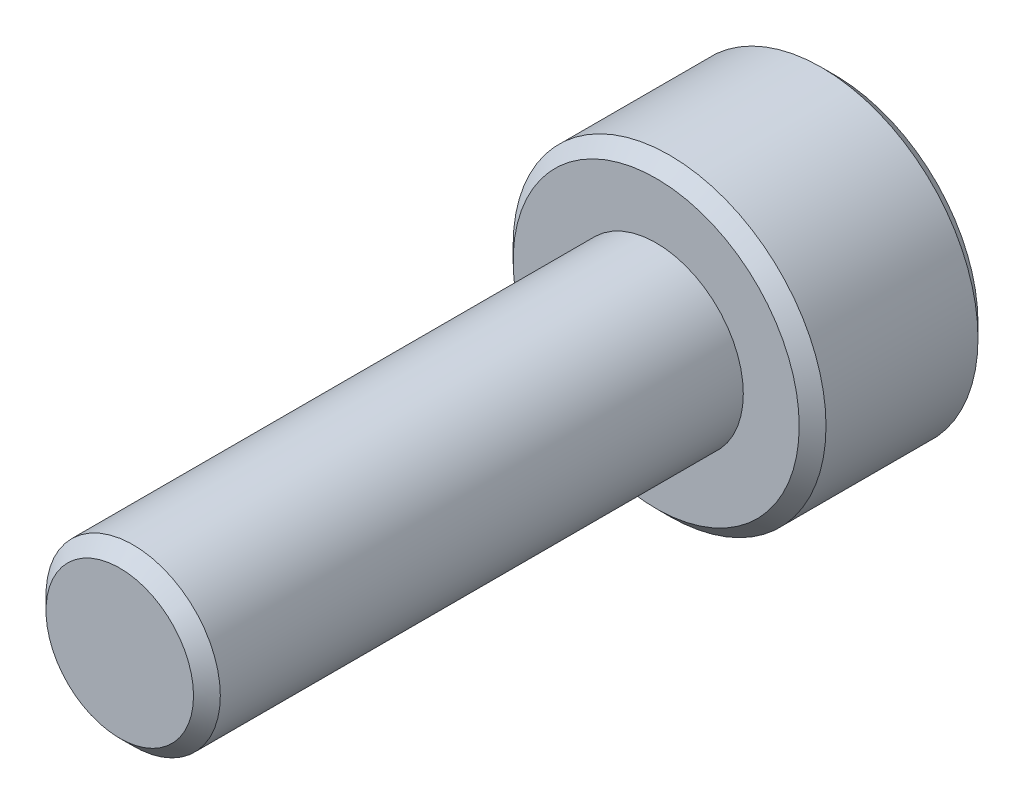
ISO-10303-21;
HEADER;
FILE_DESCRIPTION(('STEP AP214'),'2;1');
FILE_NAME('part.step','',(''),(''),'','','');
FILE_SCHEMA(('AUTOMOTIVE_DESIGN { 1 0 10303 214 1 1 1 1 }'));
ENDSEC;
DATA;
#1=APPLICATION_CONTEXT('core data for automotive mechanical design processes');
#2=APPLICATION_PROTOCOL_DEFINITION('international standard','automotive_design',2000,#1);
#3=PRODUCT_CONTEXT('',#1,'mechanical');
#4=PRODUCT('Part','Part','',(#3));
#5=PRODUCT_RELATED_PRODUCT_CATEGORY('part','',(#4));
#6=PRODUCT_DEFINITION_FORMATION('','',#4);
#7=PRODUCT_DEFINITION_CONTEXT('part definition',#1,'design');
#8=PRODUCT_DEFINITION('design','',#6,#7);
#9=PRODUCT_DEFINITION_SHAPE('','',#8);
#10=(LENGTH_UNIT() NAMED_UNIT(*) SI_UNIT(.MILLI.,.METRE.));
#11=(NAMED_UNIT(*) PLANE_ANGLE_UNIT() SI_UNIT($,.RADIAN.));
#12=(NAMED_UNIT(*) SI_UNIT($,.STERADIAN.) SOLID_ANGLE_UNIT());
#13=UNCERTAINTY_MEASURE_WITH_UNIT(LENGTH_MEASURE(1.E-05),#10,'distance_accuracy_value','');
#14=(GEOMETRIC_REPRESENTATION_CONTEXT(3) GLOBAL_UNCERTAINTY_ASSIGNED_CONTEXT((#13)) GLOBAL_UNIT_ASSIGNED_CONTEXT((#10,
#11,#12)) REPRESENTATION_CONTEXT('',''));
#15=CARTESIAN_POINT('',(0.,0.,0.));
#16=DIRECTION('',(0.,0.,1.));
#17=DIRECTION('',(1.,0.,0.));
#18=AXIS2_PLACEMENT_3D('',#15,#16,#17);
#19=CARTESIAN_POINT('',(0.,0.,4.));
#20=DIRECTION('',(0.,0.,-1.));
#21=DIRECTION('',(-1.,0.,0.));
#22=AXIS2_PLACEMENT_3D('',#19,#20,#21);
#23=CYLINDRICAL_SURFACE('',#22,3.5);
#24=CARTESIAN_POINT('',(0.,0.,3.7));
#25=DIRECTION('',(0.,0.,1.));
#26=DIRECTION('',(1.,0.,0.));
#27=AXIS2_PLACEMENT_3D('',#24,#25,#26);
#28=CIRCLE('',#27,3.5);
#29=CARTESIAN_POINT('',(3.5,0.,3.7));
#30=VERTEX_POINT('',#29);
#31=EDGE_CURVE('E176',#30,#30,#28,.F.);
#32=ORIENTED_EDGE('',*,*,#31,.T.);
#33=EDGE_LOOP('',(#32));
#34=FACE_BOUND('',#33,.T.);
#35=CARTESIAN_POINT('',(0.,0.,0.300000000000004));
#36=DIRECTION('',(0.,0.,1.));
#37=DIRECTION('',(1.,0.,0.));
#38=AXIS2_PLACEMENT_3D('',#35,#36,#37);
#39=CIRCLE('',#38,3.5);
#40=CARTESIAN_POINT('',(3.5,0.,0.300000000000004));
#41=VERTEX_POINT('',#40);
#42=EDGE_CURVE('E172',#41,#41,#39,.T.);
#43=ORIENTED_EDGE('',*,*,#42,.T.);
#44=EDGE_LOOP('',(#43));
#45=FACE_BOUND('',#44,.T.);
#46=ADVANCED_FACE('F38',(#34,#45),#23,.T.);
#47=CARTESIAN_POINT('',(0.,0.,4.));
#48=DIRECTION('',(0.,0.,1.));
#49=DIRECTION('',(1.,0.,0.));
#50=AXIS2_PLACEMENT_3D('',#47,#48,#49);
#51=PLANE('',#50);
#52=CARTESIAN_POINT('',(0.,0.,4.));
#53=DIRECTION('',(0.,0.,1.));
#54=DIRECTION('',(1.,0.,0.));
#55=AXIS2_PLACEMENT_3D('',#52,#53,#54);
#56=CIRCLE('',#55,3.2);
#57=CARTESIAN_POINT('',(3.2,0.,4.));
#58=VERTEX_POINT('',#57);
#59=EDGE_CURVE('E168',#58,#58,#56,.T.);
#60=ORIENTED_EDGE('',*,*,#59,.T.);
#61=EDGE_LOOP('',(#60));
#62=FACE_BOUND('',#61,.T.);
#63=CARTESIAN_POINT('',(0.,0.,4.));
#64=DIRECTION('',(0.,0.,1.));
#65=DIRECTION('',(1.,0.,0.));
#66=AXIS2_PLACEMENT_3D('',#63,#64,#65);
#67=CIRCLE('',#66,1.95);
#68=CARTESIAN_POINT('',(1.95,0.,4.));
#69=VERTEX_POINT('',#68);
#70=EDGE_CURVE('E156',#69,#69,#67,.T.);
#71=ORIENTED_EDGE('',*,*,#70,.F.);
#72=EDGE_LOOP('',(#71));
#73=FACE_BOUND('',#72,.T.);
#74=ADVANCED_FACE('F204',(#62,#73),#51,.T.);
#75=CARTESIAN_POINT('',(0.,0.,0.));
#76=DIRECTION('',(0.,0.,1.));
#77=DIRECTION('',(1.,0.,0.));
#78=AXIS2_PLACEMENT_3D('',#75,#76,#77);
#79=PLANE('',#78);
#80=DIRECTION('',(0.866025403784439,0.5,0.));
#81=VECTOR('',#80,1.);
#82=CARTESIAN_POINT('',(-1.5,0.866025403784438,0.));
#83=LINE('',#82,#81);
#84=CARTESIAN_POINT('',(-1.5,0.866025403784438,0.));
#85=VERTEX_POINT('',#84);
#86=CARTESIAN_POINT('',(0.,1.73205080756888,0.));
#87=VERTEX_POINT('',#86);
#88=EDGE_CURVE('E138',#85,#87,#83,.T.);
#89=ORIENTED_EDGE('',*,*,#88,.F.);
#90=DIRECTION('',(0.,1.,0.));
#91=VECTOR('',#90,1.);
#92=CARTESIAN_POINT('',(-1.5,-0.866025403784439,0.));
#93=LINE('',#92,#91);
#94=CARTESIAN_POINT('',(-1.5,-0.866025403784439,0.));
#95=VERTEX_POINT('',#94);
#96=EDGE_CURVE('E55',#95,#85,#93,.T.);
#97=ORIENTED_EDGE('',*,*,#96,.F.);
#98=DIRECTION('',(-0.866025403784439,0.5,0.));
#99=VECTOR('',#98,1.);
#100=CARTESIAN_POINT('',(0.,-1.73205080756888,0.));
#101=LINE('',#100,#99);
#102=CARTESIAN_POINT('',(0.,-1.73205080756888,0.));
#103=VERTEX_POINT('',#102);
#104=EDGE_CURVE('E150',#103,#95,#101,.T.);
#105=ORIENTED_EDGE('',*,*,#104,.F.);
#106=DIRECTION('',(-0.866025403784439,-0.5,0.));
#107=VECTOR('',#106,1.);
#108=CARTESIAN_POINT('',(1.5,-0.866025403784439,0.));
#109=LINE('',#108,#107);
#110=CARTESIAN_POINT('',(1.5,-0.866025403784439,0.));
#111=VERTEX_POINT('',#110);
#112=EDGE_CURVE('E147',#111,#103,#109,.T.);
#113=ORIENTED_EDGE('',*,*,#112,.F.);
#114=DIRECTION('',(0.,-1.,0.));
#115=VECTOR('',#114,1.);
#116=CARTESIAN_POINT('',(1.5,0.866025403784438,0.));
#117=LINE('',#116,#115);
#118=CARTESIAN_POINT('',(1.5,0.866025403784438,0.));
#119=VERTEX_POINT('',#118);
#120=EDGE_CURVE('E103',#119,#111,#117,.T.);
#121=ORIENTED_EDGE('',*,*,#120,.F.);
#122=DIRECTION('',(0.866025403784438,-0.5,0.));
#123=VECTOR('',#122,1.);
#124=CARTESIAN_POINT('',(0.,1.73205080756888,0.));
#125=LINE('',#124,#123);
#126=EDGE_CURVE('E142',#87,#119,#125,.T.);
#127=ORIENTED_EDGE('',*,*,#126,.F.);
#128=EDGE_LOOP('',(#89,#97,#105,#113,#121,#127));
#129=FACE_BOUND('',#128,.T.);
#130=CARTESIAN_POINT('',(0.,0.,0.));
#131=DIRECTION('',(0.,0.,1.));
#132=DIRECTION('',(1.,0.,0.));
#133=AXIS2_PLACEMENT_3D('',#130,#131,#132);
#134=CIRCLE('',#133,3.19999999999999);
#135=CARTESIAN_POINT('',(3.19999999999999,0.,0.));
#136=VERTEX_POINT('',#135);
#137=EDGE_CURVE('E180',#136,#136,#134,.F.);
#138=ORIENTED_EDGE('',*,*,#137,.T.);
#139=EDGE_LOOP('',(#138));
#140=FACE_BOUND('',#139,.T.);
#141=ADVANCED_FACE('F210',(#129,#140),#79,.F.);
#142=CARTESIAN_POINT('',(0.,0.,16.));
#143=DIRECTION('',(0.,0.,-1.));
#144=DIRECTION('',(-1.,0.,0.));
#145=AXIS2_PLACEMENT_3D('',#142,#143,#144);
#146=CYLINDRICAL_SURFACE('',#145,1.95);
#147=CARTESIAN_POINT('',(0.,0.,15.7));
#148=DIRECTION('',(0.,0.,1.));
#149=DIRECTION('',(1.,0.,0.));
#150=AXIS2_PLACEMENT_3D('',#147,#148,#149);
#151=CIRCLE('',#150,1.95);
#152=CARTESIAN_POINT('',(1.95,0.,15.7));
#153=VERTEX_POINT('',#152);
#154=EDGE_CURVE('E11',#153,#153,#151,.F.);
#155=ORIENTED_EDGE('',*,*,#154,.T.);
#156=EDGE_LOOP('',(#155));
#157=FACE_BOUND('',#156,.T.);
#158=ORIENTED_EDGE('',*,*,#70,.T.);
#159=EDGE_LOOP('',(#158));
#160=FACE_BOUND('',#159,.T.);
#161=ADVANCED_FACE('F229',(#157,#160),#146,.T.);
#162=CARTESIAN_POINT('',(0.,0.,16.));
#163=DIRECTION('',(0.,0.,1.));
#164=DIRECTION('',(1.,0.,0.));
#165=AXIS2_PLACEMENT_3D('',#162,#163,#164);
#166=PLANE('',#165);
#167=CARTESIAN_POINT('',(0.,0.,16.));
#168=DIRECTION('',(0.,0.,1.));
#169=DIRECTION('',(1.,0.,0.));
#170=AXIS2_PLACEMENT_3D('',#167,#168,#169);
#171=CIRCLE('',#170,1.65);
#172=CARTESIAN_POINT('',(1.65,0.,16.));
#173=VERTEX_POINT('',#172);
#174=EDGE_CURVE('E48',#173,#173,#171,.T.);
#175=ORIENTED_EDGE('',*,*,#174,.T.);
#176=EDGE_LOOP('',(#175));
#177=FACE_BOUND('',#176,.T.);
#178=ADVANCED_FACE('F188',(#177),#166,.T.);
#179=CARTESIAN_POINT('',(0.,0.,4.));
#180=DIRECTION('',(0.,0.,-1.));
#181=DIRECTION('',(-1.,0.,0.));
#182=AXIS2_PLACEMENT_3D('',#179,#180,#181);
#183=CONICAL_SURFACE('',#182,3.2,0.785398163397443);
#184=ORIENTED_EDGE('',*,*,#31,.F.);
#185=EDGE_LOOP('',(#184));
#186=FACE_BOUND('',#185,.T.);
#187=ORIENTED_EDGE('',*,*,#59,.F.);
#188=EDGE_LOOP('',(#187));
#189=FACE_BOUND('',#188,.T.);
#190=ADVANCED_FACE('F200',(#186,#189),#183,.T.);
#191=CARTESIAN_POINT('',(0.,0.,0.300000000000004));
#192=DIRECTION('',(0.,0.,1.));
#193=DIRECTION('',(1.,0.,0.));
#194=AXIS2_PLACEMENT_3D('',#191,#192,#193);
#195=CONICAL_SURFACE('',#194,3.5,0.785398163397452);
#196=ORIENTED_EDGE('',*,*,#137,.F.);
#197=EDGE_LOOP('',(#196));
#198=FACE_BOUND('',#197,.T.);
#199=ORIENTED_EDGE('',*,*,#42,.F.);
#200=EDGE_LOOP('',(#199));
#201=FACE_BOUND('',#200,.T.);
#202=ADVANCED_FACE('F192',(#198,#201),#195,.T.);
#203=CARTESIAN_POINT('',(0.,0.,16.));
#204=DIRECTION('',(0.,0.,-1.));
#205=DIRECTION('',(-1.,0.,0.));
#206=AXIS2_PLACEMENT_3D('',#203,#204,#205);
#207=CONICAL_SURFACE('',#206,1.65,0.785398163397445);
#208=ORIENTED_EDGE('',*,*,#154,.F.);
#209=EDGE_LOOP('',(#208));
#210=FACE_BOUND('',#209,.T.);
#211=ORIENTED_EDGE('',*,*,#174,.F.);
#212=EDGE_LOOP('',(#211));
#213=FACE_BOUND('',#212,.T.);
#214=ADVANCED_FACE('F41',(#210,#213),#207,.T.);
#215=CARTESIAN_POINT('',(-1.5,-0.866025403784439,2.5));
#216=DIRECTION('',(-1.,0.,0.));
#217=DIRECTION('',(0.,-1.,0.));
#218=AXIS2_PLACEMENT_3D('',#215,#216,#217);
#219=PLANE('',#218);
#220=ORIENTED_EDGE('',*,*,#96,.T.);
#221=DIRECTION('',(0.,0.,-1.));
#222=VECTOR('',#221,1.);
#223=CARTESIAN_POINT('',(-1.5,0.866025403784438,2.5));
#224=LINE('',#223,#222);
#225=CARTESIAN_POINT('',(-1.5,0.866025403784438,2.5));
#226=VERTEX_POINT('',#225);
#227=EDGE_CURVE('E85',#226,#85,#224,.T.);
#228=ORIENTED_EDGE('',*,*,#227,.F.);
#229=DIRECTION('',(0.,1.,0.));
#230=VECTOR('',#229,1.);
#231=CARTESIAN_POINT('',(-1.5,-0.866025403784439,2.5));
#232=LINE('',#231,#230);
#233=CARTESIAN_POINT('',(-1.5,-0.866025403784439,2.5));
#234=VERTEX_POINT('',#233);
#235=EDGE_CURVE('E153',#234,#226,#232,.T.);
#236=ORIENTED_EDGE('',*,*,#235,.F.);
#237=DIRECTION('',(0.,0.,-1.));
#238=VECTOR('',#237,1.);
#239=CARTESIAN_POINT('',(-1.5,-0.866025403784439,2.5));
#240=LINE('',#239,#238);
#241=EDGE_CURVE('E63',#234,#95,#240,.T.);
#242=ORIENTED_EDGE('',*,*,#241,.T.);
#243=EDGE_LOOP('',(#220,#228,#236,#242));
#244=FACE_BOUND('',#243,.T.);
#245=ADVANCED_FACE('F191',(#244),#219,.F.);
#246=CARTESIAN_POINT('',(0.,-1.73205080756888,2.5));
#247=DIRECTION('',(-0.5,-0.866025403784439,0.));
#248=DIRECTION('',(0.866025403784439,-0.5,0.));
#249=AXIS2_PLACEMENT_3D('',#246,#247,#248);
#250=PLANE('',#249);
#251=ORIENTED_EDGE('',*,*,#104,.T.);
#252=ORIENTED_EDGE('',*,*,#241,.F.);
#253=DIRECTION('',(-0.866025403784439,0.5,0.));
#254=VECTOR('',#253,1.);
#255=CARTESIAN_POINT('',(0.,-1.73205080756888,2.5));
#256=LINE('',#255,#254);
#257=CARTESIAN_POINT('',(0.,-1.73205080756888,2.5));
#258=VERTEX_POINT('',#257);
#259=EDGE_CURVE('E117',#258,#234,#256,.T.);
#260=ORIENTED_EDGE('',*,*,#259,.F.);
#261=DIRECTION('',(0.,0.,-1.));
#262=VECTOR('',#261,1.);
#263=CARTESIAN_POINT('',(0.,-1.73205080756888,2.5));
#264=LINE('',#263,#262);
#265=EDGE_CURVE('E108',#258,#103,#264,.T.);
#266=ORIENTED_EDGE('',*,*,#265,.T.);
#267=EDGE_LOOP('',(#251,#252,#260,#266));
#268=FACE_BOUND('',#267,.T.);
#269=ADVANCED_FACE('F198',(#268),#250,.F.);
#270=CARTESIAN_POINT('',(1.5,-0.866025403784439,2.5));
#271=DIRECTION('',(0.5,-0.866025403784439,0.));
#272=DIRECTION('',(0.866025403784439,0.5,0.));
#273=AXIS2_PLACEMENT_3D('',#270,#271,#272);
#274=PLANE('',#273);
#275=ORIENTED_EDGE('',*,*,#112,.T.);
#276=ORIENTED_EDGE('',*,*,#265,.F.);
#277=DIRECTION('',(-0.866025403784439,-0.5,0.));
#278=VECTOR('',#277,1.);
#279=CARTESIAN_POINT('',(1.5,-0.866025403784439,2.5));
#280=LINE('',#279,#278);
#281=CARTESIAN_POINT('',(1.5,-0.866025403784439,2.5));
#282=VERTEX_POINT('',#281);
#283=EDGE_CURVE('E112',#282,#258,#280,.T.);
#284=ORIENTED_EDGE('',*,*,#283,.F.);
#285=DIRECTION('',(0.,0.,-1.));
#286=VECTOR('',#285,1.);
#287=CARTESIAN_POINT('',(1.5,-0.866025403784439,2.5));
#288=LINE('',#287,#286);
#289=EDGE_CURVE('E96',#282,#111,#288,.T.);
#290=ORIENTED_EDGE('',*,*,#289,.T.);
#291=EDGE_LOOP('',(#275,#276,#284,#290));
#292=FACE_BOUND('',#291,.T.);
#293=ADVANCED_FACE('F113',(#292),#274,.F.);
#294=CARTESIAN_POINT('',(1.5,0.866025403784438,2.5));
#295=DIRECTION('',(1.,0.,0.));
#296=DIRECTION('',(0.,1.,0.));
#297=AXIS2_PLACEMENT_3D('',#294,#295,#296);
#298=PLANE('',#297);
#299=ORIENTED_EDGE('',*,*,#120,.T.);
#300=ORIENTED_EDGE('',*,*,#289,.F.);
#301=DIRECTION('',(0.,-1.,0.));
#302=VECTOR('',#301,1.);
#303=CARTESIAN_POINT('',(1.5,0.866025403784438,2.5));
#304=LINE('',#303,#302);
#305=CARTESIAN_POINT('',(1.5,0.866025403784438,2.5));
#306=VERTEX_POINT('',#305);
#307=EDGE_CURVE('E100',#306,#282,#304,.T.);
#308=ORIENTED_EDGE('',*,*,#307,.F.);
#309=DIRECTION('',(0.,0.,-1.));
#310=VECTOR('',#309,1.);
#311=CARTESIAN_POINT('',(1.5,0.866025403784438,2.5));
#312=LINE('',#311,#310);
#313=EDGE_CURVE('E109',#306,#119,#312,.T.);
#314=ORIENTED_EDGE('',*,*,#313,.T.);
#315=EDGE_LOOP('',(#299,#300,#308,#314));
#316=FACE_BOUND('',#315,.T.);
#317=ADVANCED_FACE('F98',(#316),#298,.F.);
#318=CARTESIAN_POINT('',(0.,1.73205080756888,2.5));
#319=DIRECTION('',(0.5,0.866025403784438,0.));
#320=DIRECTION('',(-0.866025403784439,0.5,0.));
#321=AXIS2_PLACEMENT_3D('',#318,#319,#320);
#322=PLANE('',#321);
#323=ORIENTED_EDGE('',*,*,#126,.T.);
#324=ORIENTED_EDGE('',*,*,#313,.F.);
#325=DIRECTION('',(0.866025403784438,-0.5,0.));
#326=VECTOR('',#325,1.);
#327=CARTESIAN_POINT('',(0.,1.73205080756888,2.5));
#328=LINE('',#327,#326);
#329=CARTESIAN_POINT('',(0.,1.73205080756888,2.5));
#330=VERTEX_POINT('',#329);
#331=EDGE_CURVE('E123',#330,#306,#328,.T.);
#332=ORIENTED_EDGE('',*,*,#331,.F.);
#333=DIRECTION('',(0.,0.,-1.));
#334=VECTOR('',#333,1.);
#335=CARTESIAN_POINT('',(0.,1.73205080756888,2.5));
#336=LINE('',#335,#334);
#337=EDGE_CURVE('E160',#330,#87,#336,.T.);
#338=ORIENTED_EDGE('',*,*,#337,.T.);
#339=EDGE_LOOP('',(#323,#324,#332,#338));
#340=FACE_BOUND('',#339,.T.);
#341=ADVANCED_FACE('F248',(#340),#322,.F.);
#342=CARTESIAN_POINT('',(-1.5,0.866025403784438,2.5));
#343=DIRECTION('',(-0.5,0.866025403784439,0.));
#344=DIRECTION('',(-0.866025403784439,-0.5,0.));
#345=AXIS2_PLACEMENT_3D('',#342,#343,#344);
#346=PLANE('',#345);
#347=ORIENTED_EDGE('',*,*,#88,.T.);
#348=ORIENTED_EDGE('',*,*,#337,.F.);
#349=DIRECTION('',(0.866025403784439,0.5,0.));
#350=VECTOR('',#349,1.);
#351=CARTESIAN_POINT('',(-1.5,0.866025403784438,2.5));
#352=LINE('',#351,#350);
#353=EDGE_CURVE('E130',#226,#330,#352,.T.);
#354=ORIENTED_EDGE('',*,*,#353,.F.);
#355=ORIENTED_EDGE('',*,*,#227,.T.);
#356=EDGE_LOOP('',(#347,#348,#354,#355));
#357=FACE_BOUND('',#356,.T.);
#358=ADVANCED_FACE('F245',(#357),#346,.F.);
#359=CARTESIAN_POINT('',(0.,0.,2.5));
#360=DIRECTION('',(0.,0.,-1.));
#361=DIRECTION('',(-1.,0.,0.));
#362=AXIS2_PLACEMENT_3D('',#359,#360,#361);
#363=PLANE('',#362);
#364=ORIENTED_EDGE('',*,*,#235,.T.);
#365=ORIENTED_EDGE('',*,*,#353,.T.);
#366=ORIENTED_EDGE('',*,*,#331,.T.);
#367=ORIENTED_EDGE('',*,*,#307,.T.);
#368=ORIENTED_EDGE('',*,*,#283,.T.);
#369=ORIENTED_EDGE('',*,*,#259,.T.);
#370=EDGE_LOOP('',(#364,#365,#366,#367,#368,#369));
#371=FACE_BOUND('',#370,.T.);
#372=ADVANCED_FACE('F120',(#371),#363,.T.);
#373=CLOSED_SHELL('',(#46,#74,#141,#161,#178,#190,#202,#214,#245,#269,#293,#317,#341,#358,#372));
#374=MANIFOLD_SOLID_BREP('B2',#373);
#375=ADVANCED_BREP_SHAPE_REPRESENTATION('',(#18,#374),#14);
#376=SHAPE_DEFINITION_REPRESENTATION(#9,#375);
ENDSEC;
END-ISO-10303-21;
